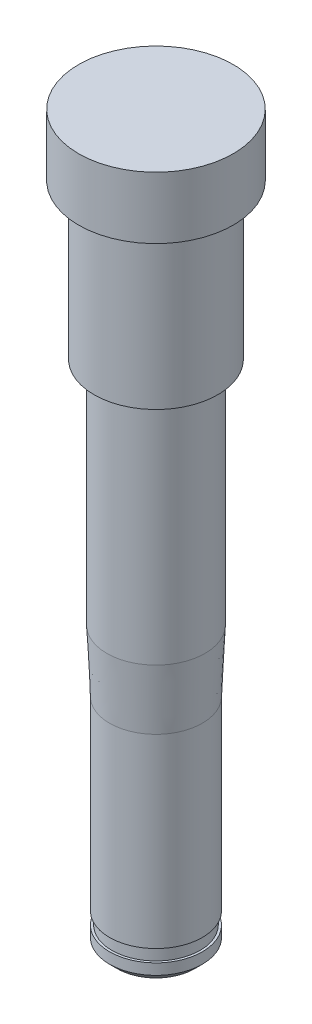
ISO-10303-21;
HEADER;
FILE_DESCRIPTION(('STEP AP214'),'2;1');
FILE_NAME('part.step','',(''),(''),'','','');
FILE_SCHEMA(('AUTOMOTIVE_DESIGN { 1 0 10303 214 1 1 1 1 }'));
ENDSEC;
DATA;
#1=APPLICATION_CONTEXT('core data for automotive mechanical design processes');
#2=APPLICATION_PROTOCOL_DEFINITION('international standard','automotive_design',2000,#1);
#3=PRODUCT_CONTEXT('',#1,'mechanical');
#4=PRODUCT('Part','Part','',(#3));
#5=PRODUCT_RELATED_PRODUCT_CATEGORY('part','',(#4));
#6=PRODUCT_DEFINITION_FORMATION('','',#4);
#7=PRODUCT_DEFINITION_CONTEXT('part definition',#1,'design');
#8=PRODUCT_DEFINITION('design','',#6,#7);
#9=PRODUCT_DEFINITION_SHAPE('','',#8);
#10=(LENGTH_UNIT() NAMED_UNIT(*) SI_UNIT(.MILLI.,.METRE.));
#11=(NAMED_UNIT(*) PLANE_ANGLE_UNIT() SI_UNIT($,.RADIAN.));
#12=(NAMED_UNIT(*) SI_UNIT($,.STERADIAN.) SOLID_ANGLE_UNIT());
#13=UNCERTAINTY_MEASURE_WITH_UNIT(LENGTH_MEASURE(1.E-05),#10,'distance_accuracy_value','');
#14=(GEOMETRIC_REPRESENTATION_CONTEXT(3) GLOBAL_UNCERTAINTY_ASSIGNED_CONTEXT((#13)) GLOBAL_UNIT_ASSIGNED_CONTEXT((#10,
#11,#12)) REPRESENTATION_CONTEXT('',''));
#15=CARTESIAN_POINT('',(0.,0.,0.));
#16=DIRECTION('',(0.,0.,1.));
#17=DIRECTION('',(1.,0.,0.));
#18=AXIS2_PLACEMENT_3D('',#15,#16,#17);
#19=CARTESIAN_POINT('',(0.,55.,0.));
#20=DIRECTION('',(0.,1.,0.));
#21=DIRECTION('',(0.,0.,1.));
#22=AXIS2_PLACEMENT_3D('',#19,#20,#21);
#23=CYLINDRICAL_SURFACE('',#22,3.);
#24=CARTESIAN_POINT('',(0.,-2.9,0.));
#25=DIRECTION('',(0.,1.,0.));
#26=DIRECTION('',(0.,0.,1.));
#27=AXIS2_PLACEMENT_3D('',#24,#25,#26);
#28=CIRCLE('',#27,3.);
#29=CARTESIAN_POINT('',(0.,-2.9,3.));
#30=VERTEX_POINT('',#29);
#31=EDGE_CURVE('E80',#30,#30,#28,.T.);
#32=ORIENTED_EDGE('',*,*,#31,.F.);
#33=EDGE_LOOP('',(#32));
#34=FACE_BOUND('',#33,.T.);
#35=CARTESIAN_POINT('',(0.,-14.9,0.));
#36=DIRECTION('',(0.,1.,0.));
#37=DIRECTION('',(0.,0.,1.));
#38=AXIS2_PLACEMENT_3D('',#35,#36,#37);
#39=CIRCLE('',#38,3.);
#40=CARTESIAN_POINT('',(0.,-14.9,3.));
#41=VERTEX_POINT('',#40);
#42=EDGE_CURVE('E84',#41,#41,#39,.T.);
#43=ORIENTED_EDGE('',*,*,#42,.T.);
#44=EDGE_LOOP('',(#43));
#45=FACE_BOUND('',#44,.T.);
#46=ADVANCED_FACE('F39',(#34,#45),#23,.T.);
#47=CARTESIAN_POINT('',(0.,30.,0.));
#48=DIRECTION('',(0.,1.,0.));
#49=DIRECTION('',(0.,0.,1.));
#50=AXIS2_PLACEMENT_3D('',#47,#48,#49);
#51=PLANE('',#50);
#52=CARTESIAN_POINT('',(0.,30.,0.));
#53=DIRECTION('',(0.,1.,0.));
#54=DIRECTION('',(0.,0.,1.));
#55=AXIS2_PLACEMENT_3D('',#52,#53,#54);
#56=CIRCLE('',#55,5.);
#57=CARTESIAN_POINT('',(0.,30.,5.));
#58=VERTEX_POINT('',#57);
#59=EDGE_CURVE('E53',#58,#58,#56,.T.);
#60=ORIENTED_EDGE('',*,*,#59,.T.);
#61=EDGE_LOOP('',(#60));
#62=FACE_BOUND('',#61,.T.);
#63=ADVANCED_FACE('F115',(#62),#51,.T.);
#64=CARTESIAN_POINT('',(0.,55.,0.));
#65=DIRECTION('',(0.,1.,0.));
#66=DIRECTION('',(0.,0.,1.));
#67=AXIS2_PLACEMENT_3D('',#64,#65,#66);
#68=CYLINDRICAL_SURFACE('',#67,5.);
#69=CARTESIAN_POINT('',(0.,26.,0.));
#70=DIRECTION('',(0.,1.,0.));
#71=DIRECTION('',(0.,0.,1.));
#72=AXIS2_PLACEMENT_3D('',#69,#70,#71);
#73=CIRCLE('',#72,5.);
#74=CARTESIAN_POINT('',(0.,26.,5.));
#75=VERTEX_POINT('',#74);
#76=EDGE_CURVE('E58',#75,#75,#73,.T.);
#77=ORIENTED_EDGE('',*,*,#76,.T.);
#78=EDGE_LOOP('',(#77));
#79=FACE_BOUND('',#78,.T.);
#80=ORIENTED_EDGE('',*,*,#59,.F.);
#81=EDGE_LOOP('',(#80));
#82=FACE_BOUND('',#81,.T.);
#83=ADVANCED_FACE('F120',(#79,#82),#68,.T.);
#84=CARTESIAN_POINT('',(-4.,26.,0.));
#85=DIRECTION('',(0.,-1.,0.));
#86=DIRECTION('',(0.,0.,-1.));
#87=AXIS2_PLACEMENT_3D('',#84,#85,#86);
#88=PLANE('',#87);
#89=CARTESIAN_POINT('',(0.,26.,0.));
#90=DIRECTION('',(0.,1.,0.));
#91=DIRECTION('',(0.,0.,1.));
#92=AXIS2_PLACEMENT_3D('',#89,#90,#91);
#93=CIRCLE('',#92,4.);
#94=CARTESIAN_POINT('',(0.,26.,4.));
#95=VERTEX_POINT('',#94);
#96=EDGE_CURVE('E64',#95,#95,#93,.T.);
#97=ORIENTED_EDGE('',*,*,#96,.T.);
#98=EDGE_LOOP('',(#97));
#99=FACE_BOUND('',#98,.T.);
#100=ORIENTED_EDGE('',*,*,#76,.F.);
#101=EDGE_LOOP('',(#100));
#102=FACE_BOUND('',#101,.T.);
#103=ADVANCED_FACE('F150',(#99,#102),#88,.T.);
#104=CARTESIAN_POINT('',(0.,55.,0.));
#105=DIRECTION('',(0.,1.,0.));
#106=DIRECTION('',(0.,0.,1.));
#107=AXIS2_PLACEMENT_3D('',#104,#105,#106);
#108=CYLINDRICAL_SURFACE('',#107,4.);
#109=CARTESIAN_POINT('',(0.,16.,0.));
#110=DIRECTION('',(0.,1.,0.));
#111=DIRECTION('',(0.,0.,1.));
#112=AXIS2_PLACEMENT_3D('',#109,#110,#111);
#113=CIRCLE('',#112,4.);
#114=CARTESIAN_POINT('',(0.,16.,4.));
#115=VERTEX_POINT('',#114);
#116=EDGE_CURVE('E68',#115,#115,#113,.T.);
#117=ORIENTED_EDGE('',*,*,#116,.T.);
#118=EDGE_LOOP('',(#117));
#119=FACE_BOUND('',#118,.T.);
#120=ORIENTED_EDGE('',*,*,#96,.F.);
#121=EDGE_LOOP('',(#120));
#122=FACE_BOUND('',#121,.T.);
#123=ADVANCED_FACE('F154',(#119,#122),#108,.T.);
#124=CARTESIAN_POINT('',(-3.175,16.,0.));
#125=DIRECTION('',(0.,-1.,0.));
#126=DIRECTION('',(0.,0.,-1.));
#127=AXIS2_PLACEMENT_3D('',#124,#125,#126);
#128=PLANE('',#127);
#129=CARTESIAN_POINT('',(0.,16.,0.));
#130=DIRECTION('',(0.,1.,0.));
#131=DIRECTION('',(0.,0.,1.));
#132=AXIS2_PLACEMENT_3D('',#129,#130,#131);
#133=CIRCLE('',#132,3.175);
#134=CARTESIAN_POINT('',(0.,16.,3.175));
#135=VERTEX_POINT('',#134);
#136=EDGE_CURVE('E72',#135,#135,#133,.T.);
#137=ORIENTED_EDGE('',*,*,#136,.T.);
#138=EDGE_LOOP('',(#137));
#139=FACE_BOUND('',#138,.T.);
#140=ORIENTED_EDGE('',*,*,#116,.F.);
#141=EDGE_LOOP('',(#140));
#142=FACE_BOUND('',#141,.T.);
#143=ADVANCED_FACE('F158',(#139,#142),#128,.T.);
#144=CARTESIAN_POINT('',(0.,55.,0.));
#145=DIRECTION('',(0.,1.,0.));
#146=DIRECTION('',(0.,0.,1.));
#147=AXIS2_PLACEMENT_3D('',#144,#145,#146);
#148=CYLINDRICAL_SURFACE('',#147,3.175);
#149=CARTESIAN_POINT('',(0.,1.1,0.));
#150=DIRECTION('',(0.,1.,0.));
#151=DIRECTION('',(0.,0.,1.));
#152=AXIS2_PLACEMENT_3D('',#149,#150,#151);
#153=CIRCLE('',#152,3.175);
#154=CARTESIAN_POINT('',(0.,1.1,3.175));
#155=VERTEX_POINT('',#154);
#156=EDGE_CURVE('E76',#155,#155,#153,.T.);
#157=ORIENTED_EDGE('',*,*,#156,.T.);
#158=EDGE_LOOP('',(#157));
#159=FACE_BOUND('',#158,.T.);
#160=ORIENTED_EDGE('',*,*,#136,.F.);
#161=EDGE_LOOP('',(#160));
#162=FACE_BOUND('',#161,.T.);
#163=ADVANCED_FACE('F138',(#159,#162),#148,.T.);
#164=CARTESIAN_POINT('',(0.,-2.9,0.));
#165=DIRECTION('',(0.,1.,0.));
#166=DIRECTION('',(0.,0.,1.));
#167=AXIS2_PLACEMENT_3D('',#164,#165,#166);
#168=CONICAL_SURFACE('',#167,3.,0.0437221186015875);
#169=ORIENTED_EDGE('',*,*,#156,.F.);
#170=EDGE_LOOP('',(#169));
#171=FACE_BOUND('',#170,.T.);
#172=ORIENTED_EDGE('',*,*,#31,.T.);
#173=EDGE_LOOP('',(#172));
#174=FACE_BOUND('',#173,.T.);
#175=ADVANCED_FACE('F130',(#171,#174),#168,.T.);
#176=CARTESIAN_POINT('',(0.,-14.9,-3.));
#177=DIRECTION('',(0.,-1.,0.));
#178=DIRECTION('',(0.,0.,-1.));
#179=AXIS2_PLACEMENT_3D('',#176,#177,#178);
#180=PLANE('',#179);
#181=CARTESIAN_POINT('',(0.,-14.9,0.));
#182=DIRECTION('',(0.,1.,0.));
#183=DIRECTION('',(0.,0.,1.));
#184=AXIS2_PLACEMENT_3D('',#181,#182,#183);
#185=CIRCLE('',#184,2.85);
#186=CARTESIAN_POINT('',(0.,-14.9,2.85));
#187=VERTEX_POINT('',#186);
#188=EDGE_CURVE('E88',#187,#187,#185,.T.);
#189=ORIENTED_EDGE('',*,*,#188,.T.);
#190=EDGE_LOOP('',(#189));
#191=FACE_BOUND('',#190,.T.);
#192=ORIENTED_EDGE('',*,*,#42,.F.);
#193=EDGE_LOOP('',(#192));
#194=FACE_BOUND('',#193,.T.);
#195=ADVANCED_FACE('F127',(#191,#194),#180,.T.);
#196=CARTESIAN_POINT('',(0.,55.,0.));
#197=DIRECTION('',(0.,1.,0.));
#198=DIRECTION('',(0.,0.,1.));
#199=AXIS2_PLACEMENT_3D('',#196,#197,#198);
#200=CYLINDRICAL_SURFACE('',#199,2.85);
#201=CARTESIAN_POINT('',(0.,-15.7,0.));
#202=DIRECTION('',(0.,1.,0.));
#203=DIRECTION('',(0.,0.,1.));
#204=AXIS2_PLACEMENT_3D('',#201,#202,#203);
#205=CIRCLE('',#204,2.85);
#206=CARTESIAN_POINT('',(0.,-15.7,2.85));
#207=VERTEX_POINT('',#206);
#208=EDGE_CURVE('E92',#207,#207,#205,.T.);
#209=ORIENTED_EDGE('',*,*,#208,.T.);
#210=EDGE_LOOP('',(#209));
#211=FACE_BOUND('',#210,.T.);
#212=ORIENTED_EDGE('',*,*,#188,.F.);
#213=EDGE_LOOP('',(#212));
#214=FACE_BOUND('',#213,.T.);
#215=ADVANCED_FACE('F129',(#211,#214),#200,.T.);
#216=CARTESIAN_POINT('',(0.,-15.7,-3.));
#217=DIRECTION('',(0.,1.,0.));
#218=DIRECTION('',(0.,0.,1.));
#219=AXIS2_PLACEMENT_3D('',#216,#217,#218);
#220=PLANE('',#219);
#221=CARTESIAN_POINT('',(0.,-15.7,0.));
#222=DIRECTION('',(0.,1.,0.));
#223=DIRECTION('',(0.,0.,1.));
#224=AXIS2_PLACEMENT_3D('',#221,#222,#223);
#225=CIRCLE('',#224,3.);
#226=CARTESIAN_POINT('',(0.,-15.7,3.));
#227=VERTEX_POINT('',#226);
#228=EDGE_CURVE('E96',#227,#227,#225,.T.);
#229=ORIENTED_EDGE('',*,*,#228,.T.);
#230=EDGE_LOOP('',(#229));
#231=FACE_BOUND('',#230,.T.);
#232=ORIENTED_EDGE('',*,*,#208,.F.);
#233=EDGE_LOOP('',(#232));
#234=FACE_BOUND('',#233,.T.);
#235=ADVANCED_FACE('F101',(#231,#234),#220,.T.);
#236=CARTESIAN_POINT('',(0.,-16.9,0.));
#237=DIRECTION('',(0.,-1.,0.));
#238=DIRECTION('',(0.,0.,-1.));
#239=AXIS2_PLACEMENT_3D('',#236,#237,#238);
#240=PLANE('',#239);
#241=CARTESIAN_POINT('',(0.,-16.9,0.));
#242=DIRECTION('',(0.,-1.,0.));
#243=DIRECTION('',(0.,0.,-1.));
#244=AXIS2_PLACEMENT_3D('',#241,#242,#243);
#245=CIRCLE('',#244,2.5);
#246=CARTESIAN_POINT('',(0.,-16.9,-2.5));
#247=VERTEX_POINT('',#246);
#248=EDGE_CURVE('E10',#247,#247,#245,.T.);
#249=ORIENTED_EDGE('',*,*,#248,.T.);
#250=EDGE_LOOP('',(#249));
#251=FACE_BOUND('',#250,.T.);
#252=ADVANCED_FACE('F110',(#251),#240,.T.);
#253=CARTESIAN_POINT('',(0.,-16.4,0.));
#254=DIRECTION('',(0.,1.,0.));
#255=DIRECTION('',(0.,0.,1.));
#256=AXIS2_PLACEMENT_3D('',#253,#254,#255);
#257=CONICAL_SURFACE('',#256,3.,0.785398163397453);
#258=ORIENTED_EDGE('',*,*,#248,.F.);
#259=EDGE_LOOP('',(#258));
#260=FACE_BOUND('',#259,.T.);
#261=CARTESIAN_POINT('',(0.,-16.4,0.));
#262=DIRECTION('',(0.,-1.,0.));
#263=DIRECTION('',(0.,0.,-1.));
#264=AXIS2_PLACEMENT_3D('',#261,#262,#263);
#265=CIRCLE('',#264,3.);
#266=CARTESIAN_POINT('',(0.,-16.4,-3.));
#267=VERTEX_POINT('',#266);
#268=EDGE_CURVE('E48',#267,#267,#265,.F.);
#269=ORIENTED_EDGE('',*,*,#268,.F.);
#270=EDGE_LOOP('',(#269));
#271=FACE_BOUND('',#270,.T.);
#272=ADVANCED_FACE('F42',(#260,#271),#257,.T.);
#273=ORIENTED_EDGE('',*,*,#268,.T.);
#274=EDGE_LOOP('',(#273));
#275=FACE_BOUND('',#274,.T.);
#276=ORIENTED_EDGE('',*,*,#228,.F.);
#277=EDGE_LOOP('',(#276));
#278=FACE_BOUND('',#277,.T.);
#279=ADVANCED_FACE('F104',(#275,#278),#23,.T.);
#280=CLOSED_SHELL('',(#46,#63,#83,#103,#123,#143,#163,#175,#195,#215,#235,#252,#272,#279));
#281=MANIFOLD_SOLID_BREP('B2',#280);
#282=ADVANCED_BREP_SHAPE_REPRESENTATION('',(#18,#281),#14);
#283=SHAPE_DEFINITION_REPRESENTATION(#9,#282);
ENDSEC;
END-ISO-10303-21;
